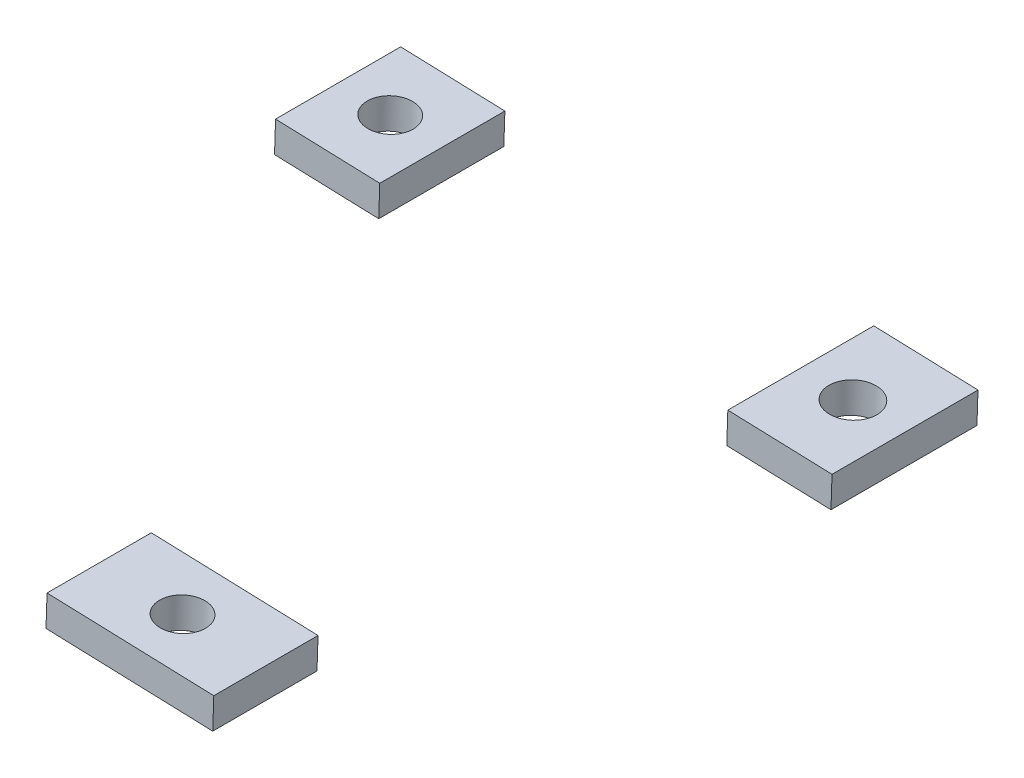
ISO-10303-21;
HEADER;
FILE_DESCRIPTION(('STEP AP214'),'2;1');
FILE_NAME('part.step','',(''),(''),'','','');
FILE_SCHEMA(('AUTOMOTIVE_DESIGN { 1 0 10303 214 1 1 1 1 }'));
ENDSEC;
DATA;
#1=APPLICATION_CONTEXT('core data for automotive mechanical design processes');
#2=APPLICATION_PROTOCOL_DEFINITION('international standard','automotive_design',2000,#1);
#3=PRODUCT_CONTEXT('',#1,'mechanical');
#4=PRODUCT('Part','Part','',(#3));
#5=PRODUCT_RELATED_PRODUCT_CATEGORY('part','',(#4));
#6=PRODUCT_DEFINITION_FORMATION('','',#4);
#7=PRODUCT_DEFINITION_CONTEXT('part definition',#1,'design');
#8=PRODUCT_DEFINITION('design','',#6,#7);
#9=PRODUCT_DEFINITION_SHAPE('','',#8);
#10=(LENGTH_UNIT() NAMED_UNIT(*) SI_UNIT(.MILLI.,.METRE.));
#11=(NAMED_UNIT(*) PLANE_ANGLE_UNIT() SI_UNIT($,.RADIAN.));
#12=(NAMED_UNIT(*) SI_UNIT($,.STERADIAN.) SOLID_ANGLE_UNIT());
#13=UNCERTAINTY_MEASURE_WITH_UNIT(LENGTH_MEASURE(1.E-05),#10,'distance_accuracy_value','');
#14=(GEOMETRIC_REPRESENTATION_CONTEXT(3) GLOBAL_UNCERTAINTY_ASSIGNED_CONTEXT((#13)) GLOBAL_UNIT_ASSIGNED_CONTEXT((#10,
#11,#12)) REPRESENTATION_CONTEXT('',''));
#15=CARTESIAN_POINT('',(0.,0.,0.));
#16=DIRECTION('',(0.,0.,1.));
#17=DIRECTION('',(1.,0.,0.));
#18=AXIS2_PLACEMENT_3D('',#15,#16,#17);
#19=CARTESIAN_POINT('',(0.212463980012952,6.35050439021801,0.));
#20=DIRECTION('',(0.0334375286000042,0.999440809493551,0.));
#21=DIRECTION('',(-0.999440809493551,0.0334375286000042,0.));
#22=AXIS2_PLACEMENT_3D('',#19,#20,#21);
#23=PLANE('',#22);
#24=DIRECTION('',(0.,0.,1.));
#25=VECTOR('',#24,1.);
#26=CARTESIAN_POINT('',(-129.601123923486,10.6935785542518,90.2089062050544));
#27=LINE('',#26,#25);
#28=CARTESIAN_POINT('',(-129.601123923486,10.6935785542518,90.2089062050544));
#29=VERTEX_POINT('',#28);
#30=CARTESIAN_POINT('',(-129.601123923486,10.6935785542518,96.2089063250876));
#31=VERTEX_POINT('',#30);
#32=EDGE_CURVE('E96',#29,#31,#27,.T.);
#33=ORIENTED_EDGE('',*,*,#32,.T.);
#34=DIRECTION('',(0.999440809493551,-0.0334375286000042,0.));
#35=VECTOR('',#34,1.);
#36=CARTESIAN_POINT('',(-129.601123923486,10.6935785542518,96.2089063250876));
#37=LINE('',#36,#35);
#38=CARTESIAN_POINT('',(-124.603919876019,10.5263909112517,96.2089063250876));
#39=VERTEX_POINT('',#38);
#40=EDGE_CURVE('E91',#31,#39,#37,.T.);
#41=ORIENTED_EDGE('',*,*,#40,.T.);
#42=DIRECTION('',(0.,0.,-1.));
#43=VECTOR('',#42,1.);
#44=CARTESIAN_POINT('',(-124.603919876019,10.5263909112517,90.2089062050544));
#45=LINE('',#44,#43);
#46=CARTESIAN_POINT('',(-124.603919876019,10.5263909112517,90.2089062050544));
#47=VERTEX_POINT('',#46);
#48=EDGE_CURVE('E94',#39,#47,#45,.T.);
#49=ORIENTED_EDGE('',*,*,#48,.T.);
#50=DIRECTION('',(-0.999440809493551,0.0334375286000041,0.));
#51=VECTOR('',#50,1.);
#52=CARTESIAN_POINT('',(-129.601123923486,10.6935785542518,90.2089062050544));
#53=LINE('',#52,#51);
#54=EDGE_CURVE('E61',#47,#29,#53,.T.);
#55=ORIENTED_EDGE('',*,*,#54,.T.);
#56=EDGE_LOOP('',(#33,#41,#49,#55));
#57=FACE_BOUND('',#56,.T.);
#58=CARTESIAN_POINT('',(-127.102521899752,10.6099847327518,93.2089064467498));
#59=DIRECTION('',(0.0334375286000042,0.999440809493551,0.));
#60=DIRECTION('',(-0.999440809493551,0.0334375286000042,0.));
#61=AXIS2_PLACEMENT_3D('',#58,#59,#60);
#62=CIRCLE('',#61,1.10000000000678);
#63=CARTESIAN_POINT('',(-128.201906790202,10.646766014212,93.2089064467498));
#64=VERTEX_POINT('',#63);
#65=EDGE_CURVE('E111',#64,#64,#62,.T.);
#66=ORIENTED_EDGE('',*,*,#65,.F.);
#67=EDGE_LOOP('',(#66));
#68=FACE_BOUND('',#67,.T.);
#69=ADVANCED_FACE('F44',(#57,#68),#23,.T.);
#70=CARTESIAN_POINT('',(0.162307687112946,4.85134317597768,0.));
#71=DIRECTION('',(0.0334375286000042,0.999440809493551,0.));
#72=DIRECTION('',(-0.999440809493551,0.0334375286000042,0.));
#73=AXIS2_PLACEMENT_3D('',#70,#71,#72);
#74=PLANE('',#73);
#75=DIRECTION('',(0.,0.,1.));
#76=VECTOR('',#75,1.);
#77=CARTESIAN_POINT('',(-129.651280216386,9.19441734001144,90.2089062050544));
#78=LINE('',#77,#76);
#79=CARTESIAN_POINT('',(-129.651280216386,9.19441734001144,90.2089062050544));
#80=VERTEX_POINT('',#79);
#81=CARTESIAN_POINT('',(-129.651280216386,9.19441734001144,96.2089063250876));
#82=VERTEX_POINT('',#81);
#83=EDGE_CURVE('E108',#80,#82,#78,.T.);
#84=ORIENTED_EDGE('',*,*,#83,.F.);
#85=DIRECTION('',(-0.999440809493551,0.0334375286000041,0.));
#86=VECTOR('',#85,1.);
#87=CARTESIAN_POINT('',(-129.651280216386,9.19441734001144,90.2089062050544));
#88=LINE('',#87,#86);
#89=CARTESIAN_POINT('',(-124.654076168919,9.02722969701142,90.2089062050544));
#90=VERTEX_POINT('',#89);
#91=EDGE_CURVE('E84',#90,#80,#88,.T.);
#92=ORIENTED_EDGE('',*,*,#91,.F.);
#93=DIRECTION('',(0.,0.,-1.));
#94=VECTOR('',#93,1.);
#95=CARTESIAN_POINT('',(-124.654076168919,9.02722969701142,90.2089062050544));
#96=LINE('',#95,#94);
#97=CARTESIAN_POINT('',(-124.654076168919,9.02722969701142,96.2089063250876));
#98=VERTEX_POINT('',#97);
#99=EDGE_CURVE('E78',#98,#90,#96,.T.);
#100=ORIENTED_EDGE('',*,*,#99,.F.);
#101=DIRECTION('',(0.999440809493551,-0.0334375286000042,0.));
#102=VECTOR('',#101,1.);
#103=CARTESIAN_POINT('',(-129.651280216386,9.19441734001144,96.2089063250876));
#104=LINE('',#103,#102);
#105=EDGE_CURVE('E100',#82,#98,#104,.T.);
#106=ORIENTED_EDGE('',*,*,#105,.F.);
#107=EDGE_LOOP('',(#84,#92,#100,#106));
#108=FACE_BOUND('',#107,.T.);
#109=CARTESIAN_POINT('',(-127.152678192652,9.11082351851143,93.2089064467498));
#110=DIRECTION('',(0.0334375286000042,0.999440809493551,0.));
#111=DIRECTION('',(-0.999440809493551,0.0334375286000042,0.));
#112=AXIS2_PLACEMENT_3D('',#109,#110,#111);
#113=CIRCLE('',#112,1.10000000000678);
#114=CARTESIAN_POINT('',(-128.252063083102,9.14760479997166,93.2089064467498));
#115=VERTEX_POINT('',#114);
#116=EDGE_CURVE('E123',#115,#115,#113,.T.);
#117=ORIENTED_EDGE('',*,*,#116,.T.);
#118=EDGE_LOOP('',(#117));
#119=FACE_BOUND('',#118,.T.);
#120=ADVANCED_FACE('F119',(#108,#119),#74,.F.);
#121=CARTESIAN_POINT('',(-129.601123923486,10.6935785542518,90.2089062050544));
#122=DIRECTION('',(0.999440809493551,-0.0334375286000042,0.));
#123=DIRECTION('',(0.0334375286000042,0.999440809493551,0.));
#124=AXIS2_PLACEMENT_3D('',#121,#122,#123);
#125=PLANE('',#124);
#126=ORIENTED_EDGE('',*,*,#83,.T.);
#127=DIRECTION('',(-0.0334375286000042,-0.999440809493551,0.));
#128=VECTOR('',#127,1.);
#129=CARTESIAN_POINT('',(-129.601123923486,10.6935785542518,96.2089063250876));
#130=LINE('',#129,#128);
#131=EDGE_CURVE('E12',#31,#82,#130,.T.);
#132=ORIENTED_EDGE('',*,*,#131,.F.);
#133=ORIENTED_EDGE('',*,*,#32,.F.);
#134=DIRECTION('',(-0.0334375286000042,-0.999440809493551,0.));
#135=VECTOR('',#134,1.);
#136=CARTESIAN_POINT('',(-129.601123923486,10.6935785542518,90.2089062050544));
#137=LINE('',#136,#135);
#138=EDGE_CURVE('E104',#29,#80,#137,.T.);
#139=ORIENTED_EDGE('',*,*,#138,.T.);
#140=EDGE_LOOP('',(#126,#132,#133,#139));
#141=FACE_BOUND('',#140,.T.);
#142=ADVANCED_FACE('F46',(#141),#125,.F.);
#143=CARTESIAN_POINT('',(-129.601123923486,10.6935785542518,96.2089063250876));
#144=DIRECTION('',(0.,0.,-1.));
#145=DIRECTION('',(-1.,0.,0.));
#146=AXIS2_PLACEMENT_3D('',#143,#144,#145);
#147=PLANE('',#146);
#148=ORIENTED_EDGE('',*,*,#105,.T.);
#149=DIRECTION('',(-0.0334375286000042,-0.999440809493551,0.));
#150=VECTOR('',#149,1.);
#151=CARTESIAN_POINT('',(-124.603919876019,10.5263909112517,96.2089063250876));
#152=LINE('',#151,#150);
#153=EDGE_CURVE('E53',#39,#98,#152,.T.);
#154=ORIENTED_EDGE('',*,*,#153,.F.);
#155=ORIENTED_EDGE('',*,*,#40,.F.);
#156=ORIENTED_EDGE('',*,*,#131,.T.);
#157=EDGE_LOOP('',(#148,#154,#155,#156));
#158=FACE_BOUND('',#157,.T.);
#159=ADVANCED_FACE('F99',(#158),#147,.F.);
#160=CARTESIAN_POINT('',(-124.603919876019,10.5263909112517,90.2089062050544));
#161=DIRECTION('',(-0.999440809493551,0.0334375286000042,0.));
#162=DIRECTION('',(-0.0334375286000042,-0.999440809493551,0.));
#163=AXIS2_PLACEMENT_3D('',#160,#161,#162);
#164=PLANE('',#163);
#165=ORIENTED_EDGE('',*,*,#99,.T.);
#166=DIRECTION('',(-0.0334375286000042,-0.999440809493551,0.));
#167=VECTOR('',#166,1.);
#168=CARTESIAN_POINT('',(-124.603919876019,10.5263909112517,90.2089062050544));
#169=LINE('',#168,#167);
#170=EDGE_CURVE('E101',#47,#90,#169,.T.);
#171=ORIENTED_EDGE('',*,*,#170,.F.);
#172=ORIENTED_EDGE('',*,*,#48,.F.);
#173=ORIENTED_EDGE('',*,*,#153,.T.);
#174=EDGE_LOOP('',(#165,#171,#172,#173));
#175=FACE_BOUND('',#174,.T.);
#176=ADVANCED_FACE('F102',(#175),#164,.F.);
#177=CARTESIAN_POINT('',(-129.601123923486,10.6935785542518,90.2089062050544));
#178=DIRECTION('',(0.,0.,1.));
#179=DIRECTION('',(1.,0.,0.));
#180=AXIS2_PLACEMENT_3D('',#177,#178,#179);
#181=PLANE('',#180);
#182=ORIENTED_EDGE('',*,*,#91,.T.);
#183=ORIENTED_EDGE('',*,*,#138,.F.);
#184=ORIENTED_EDGE('',*,*,#54,.F.);
#185=ORIENTED_EDGE('',*,*,#170,.T.);
#186=EDGE_LOOP('',(#182,#183,#184,#185));
#187=FACE_BOUND('',#186,.T.);
#188=ADVANCED_FACE('F116',(#187),#181,.F.);
#189=CARTESIAN_POINT('',(-127.102521899752,10.6099847327518,93.2089064467498));
#190=DIRECTION('',(-0.0334375286000042,-0.999440809493551,0.));
#191=DIRECTION('',(0.999440809493551,-0.0334375286000042,0.));
#192=AXIS2_PLACEMENT_3D('',#189,#190,#191);
#193=CYLINDRICAL_SURFACE('',#192,1.10000000000678);
#194=ORIENTED_EDGE('',*,*,#65,.T.);
#195=EDGE_LOOP('',(#194));
#196=FACE_BOUND('',#195,.T.);
#197=ORIENTED_EDGE('',*,*,#116,.F.);
#198=EDGE_LOOP('',(#197));
#199=FACE_BOUND('',#198,.T.);
#200=ADVANCED_FACE('F129',(#196,#199),#193,.F.);
#201=CLOSED_SHELL('',(#69,#120,#142,#159,#176,#188,#200));
#202=MANIFOLD_SOLID_BREP('B2',#201);
#203=CARTESIAN_POINT('',(0.212463980012953,6.35050439021802,0.));
#204=DIRECTION('',(-0.0334375286000043,-0.999440809493551,0.));
#205=DIRECTION('',(0.999440809493551,-0.0334375286000043,0.));
#206=AXIS2_PLACEMENT_3D('',#203,#204,#205);
#207=PLANE('',#206);
#208=DIRECTION('',(0.,0.,1.));
#209=VECTOR('',#208,1.);
#210=CARTESIAN_POINT('',(-107.41353795273,9.95126541933168,96.7089074171427));
#211=LINE('',#210,#209);
#212=CARTESIAN_POINT('',(-107.41353795273,9.95126541933168,89.7089074171427));
#213=VERTEX_POINT('',#212);
#214=CARTESIAN_POINT('',(-107.41353795273,9.95126541933168,96.7089074171427));
#215=VERTEX_POINT('',#214);
#216=EDGE_CURVE('E250',#213,#215,#211,.T.);
#217=ORIENTED_EDGE('',*,*,#216,.T.);
#218=DIRECTION('',(0.999440809493551,-0.033437528600004,0.));
#219=VECTOR('',#218,1.);
#220=CARTESIAN_POINT('',(-107.41353795273,9.95126541933168,96.7089074171427));
#221=LINE('',#220,#219);
#222=CARTESIAN_POINT('',(-102.416333905262,9.78407777633165,96.7089074171426));
#223=VERTEX_POINT('',#222);
#224=EDGE_CURVE('E245',#215,#223,#221,.T.);
#225=ORIENTED_EDGE('',*,*,#224,.T.);
#226=DIRECTION('',(0.,0.,-1.));
#227=VECTOR('',#226,1.);
#228=CARTESIAN_POINT('',(-102.416333905262,9.78407777633165,96.7089074171426));
#229=LINE('',#228,#227);
#230=CARTESIAN_POINT('',(-102.416333905262,9.78407777633165,89.7089074171426));
#231=VERTEX_POINT('',#230);
#232=EDGE_CURVE('E248',#223,#231,#229,.T.);
#233=ORIENTED_EDGE('',*,*,#232,.T.);
#234=DIRECTION('',(-0.999440809493551,0.0334375286000043,0.));
#235=VECTOR('',#234,1.);
#236=CARTESIAN_POINT('',(-107.41353795273,9.95126541933168,89.7089074171427));
#237=LINE('',#236,#235);
#238=EDGE_CURVE('E215',#231,#213,#237,.T.);
#239=ORIENTED_EDGE('',*,*,#238,.T.);
#240=EDGE_LOOP('',(#217,#225,#233,#239));
#241=FACE_BOUND('',#240,.T.);
#242=CARTESIAN_POINT('',(-104.914935928996,9.86767159783167,93.2089074171426));
#243=DIRECTION('',(0.0334375286000042,0.999440809493551,0.));
#244=DIRECTION('',(-0.999440809493551,0.0334375286000042,0.));
#245=AXIS2_PLACEMENT_3D('',#242,#243,#244);
#246=CIRCLE('',#245,1.15000000000682);
#247=CARTESIAN_POINT('',(-106.06429285992,9.9061247557219,93.2089074171426));
#248=VERTEX_POINT('',#247);
#249=EDGE_CURVE('E265',#248,#248,#246,.T.);
#250=ORIENTED_EDGE('',*,*,#249,.F.);
#251=EDGE_LOOP('',(#250));
#252=FACE_BOUND('',#251,.T.);
#253=ADVANCED_FACE('F198',(#241,#252),#207,.F.);
#254=CARTESIAN_POINT('',(0.162307687112947,4.85134317597769,0.));
#255=DIRECTION('',(-0.0334375286000043,-0.999440809493551,0.));
#256=DIRECTION('',(0.999440809493551,-0.0334375286000043,0.));
#257=AXIS2_PLACEMENT_3D('',#254,#255,#256);
#258=PLANE('',#257);
#259=DIRECTION('',(0.,0.,1.));
#260=VECTOR('',#259,1.);
#261=CARTESIAN_POINT('',(-107.46369424563,8.45210420509135,96.7089074171427));
#262=LINE('',#261,#260);
#263=CARTESIAN_POINT('',(-107.46369424563,8.45210420509135,89.7089074171427));
#264=VERTEX_POINT('',#263);
#265=CARTESIAN_POINT('',(-107.46369424563,8.45210420509135,96.7089074171427));
#266=VERTEX_POINT('',#265);
#267=EDGE_CURVE('E262',#264,#266,#262,.T.);
#268=ORIENTED_EDGE('',*,*,#267,.F.);
#269=DIRECTION('',(-0.999440809493551,0.0334375286000043,0.));
#270=VECTOR('',#269,1.);
#271=CARTESIAN_POINT('',(-107.46369424563,8.45210420509135,89.7089074171427));
#272=LINE('',#271,#270);
#273=CARTESIAN_POINT('',(-102.466490198162,8.28491656209133,89.7089074171426));
#274=VERTEX_POINT('',#273);
#275=EDGE_CURVE('E238',#274,#264,#272,.T.);
#276=ORIENTED_EDGE('',*,*,#275,.F.);
#277=DIRECTION('',(0.,0.,-1.));
#278=VECTOR('',#277,1.);
#279=CARTESIAN_POINT('',(-102.466490198162,8.28491656209133,96.7089074171426));
#280=LINE('',#279,#278);
#281=CARTESIAN_POINT('',(-102.466490198162,8.28491656209133,96.7089074171426));
#282=VERTEX_POINT('',#281);
#283=EDGE_CURVE('E232',#282,#274,#280,.T.);
#284=ORIENTED_EDGE('',*,*,#283,.F.);
#285=DIRECTION('',(0.999440809493551,-0.033437528600004,0.));
#286=VECTOR('',#285,1.);
#287=CARTESIAN_POINT('',(-107.46369424563,8.45210420509135,96.7089074171427));
#288=LINE('',#287,#286);
#289=EDGE_CURVE('E254',#266,#282,#288,.T.);
#290=ORIENTED_EDGE('',*,*,#289,.F.);
#291=EDGE_LOOP('',(#268,#276,#284,#290));
#292=FACE_BOUND('',#291,.T.);
#293=CARTESIAN_POINT('',(-104.965092221896,8.36851038359134,93.2089074171426));
#294=DIRECTION('',(0.0334375286000042,0.999440809493551,0.));
#295=DIRECTION('',(-0.999440809493551,0.0334375286000042,0.));
#296=AXIS2_PLACEMENT_3D('',#293,#294,#295);
#297=CIRCLE('',#296,1.15000000000682);
#298=CARTESIAN_POINT('',(-106.11444915282,8.40696354148157,93.2089074171426));
#299=VERTEX_POINT('',#298);
#300=EDGE_CURVE('E277',#299,#299,#297,.T.);
#301=ORIENTED_EDGE('',*,*,#300,.T.);
#302=EDGE_LOOP('',(#301));
#303=FACE_BOUND('',#302,.T.);
#304=ADVANCED_FACE('F273',(#292,#303),#258,.T.);
#305=CARTESIAN_POINT('',(-107.41353795273,9.95126541933168,96.7089074171427));
#306=DIRECTION('',(0.999440809493551,-0.0334375286000042,0.));
#307=DIRECTION('',(0.0334375286000042,0.999440809493551,0.));
#308=AXIS2_PLACEMENT_3D('',#305,#306,#307);
#309=PLANE('',#308);
#310=ORIENTED_EDGE('',*,*,#267,.T.);
#311=DIRECTION('',(-0.0334375286000042,-0.999440809493551,0.));
#312=VECTOR('',#311,1.);
#313=CARTESIAN_POINT('',(-107.41353795273,9.95126541933168,96.7089074171427));
#314=LINE('',#313,#312);
#315=EDGE_CURVE('E42',#215,#266,#314,.T.);
#316=ORIENTED_EDGE('',*,*,#315,.F.);
#317=ORIENTED_EDGE('',*,*,#216,.F.);
#318=DIRECTION('',(-0.0334375286000042,-0.999440809493551,0.));
#319=VECTOR('',#318,1.);
#320=CARTESIAN_POINT('',(-107.41353795273,9.95126541933168,89.7089074171427));
#321=LINE('',#320,#319);
#322=EDGE_CURVE('E258',#213,#264,#321,.T.);
#323=ORIENTED_EDGE('',*,*,#322,.T.);
#324=EDGE_LOOP('',(#310,#316,#317,#323));
#325=FACE_BOUND('',#324,.T.);
#326=ADVANCED_FACE('F200',(#325),#309,.F.);
#327=CARTESIAN_POINT('',(-107.41353795273,9.95126541933168,96.7089074171427));
#328=DIRECTION('',(0.,0.,-1.));
#329=DIRECTION('',(-1.,0.,0.));
#330=AXIS2_PLACEMENT_3D('',#327,#328,#329);
#331=PLANE('',#330);
#332=ORIENTED_EDGE('',*,*,#289,.T.);
#333=DIRECTION('',(-0.0334375286000042,-0.999440809493551,0.));
#334=VECTOR('',#333,1.);
#335=CARTESIAN_POINT('',(-102.416333905262,9.78407777633165,96.7089074171426));
#336=LINE('',#335,#334);
#337=EDGE_CURVE('E207',#223,#282,#336,.T.);
#338=ORIENTED_EDGE('',*,*,#337,.F.);
#339=ORIENTED_EDGE('',*,*,#224,.F.);
#340=ORIENTED_EDGE('',*,*,#315,.T.);
#341=EDGE_LOOP('',(#332,#338,#339,#340));
#342=FACE_BOUND('',#341,.T.);
#343=ADVANCED_FACE('F253',(#342),#331,.F.);
#344=CARTESIAN_POINT('',(-102.416333905262,9.78407777633165,96.7089074171426));
#345=DIRECTION('',(-0.999440809493551,0.0334375286000042,0.));
#346=DIRECTION('',(-0.0334375286000042,-0.999440809493551,0.));
#347=AXIS2_PLACEMENT_3D('',#344,#345,#346);
#348=PLANE('',#347);
#349=ORIENTED_EDGE('',*,*,#283,.T.);
#350=DIRECTION('',(-0.0334375286000042,-0.999440809493551,0.));
#351=VECTOR('',#350,1.);
#352=CARTESIAN_POINT('',(-102.416333905262,9.78407777633165,89.7089074171426));
#353=LINE('',#352,#351);
#354=EDGE_CURVE('E255',#231,#274,#353,.T.);
#355=ORIENTED_EDGE('',*,*,#354,.F.);
#356=ORIENTED_EDGE('',*,*,#232,.F.);
#357=ORIENTED_EDGE('',*,*,#337,.T.);
#358=EDGE_LOOP('',(#349,#355,#356,#357));
#359=FACE_BOUND('',#358,.T.);
#360=ADVANCED_FACE('F256',(#359),#348,.F.);
#361=CARTESIAN_POINT('',(-107.41353795273,9.95126541933168,89.7089074171427));
#362=DIRECTION('',(0.,0.,1.));
#363=DIRECTION('',(1.,0.,0.));
#364=AXIS2_PLACEMENT_3D('',#361,#362,#363);
#365=PLANE('',#364);
#366=ORIENTED_EDGE('',*,*,#275,.T.);
#367=ORIENTED_EDGE('',*,*,#322,.F.);
#368=ORIENTED_EDGE('',*,*,#238,.F.);
#369=ORIENTED_EDGE('',*,*,#354,.T.);
#370=EDGE_LOOP('',(#366,#367,#368,#369));
#371=FACE_BOUND('',#370,.T.);
#372=ADVANCED_FACE('F270',(#371),#365,.F.);
#373=CARTESIAN_POINT('',(-104.914935928996,9.86767159783167,93.2089074171426));
#374=DIRECTION('',(-0.0334375286000042,-0.999440809493551,0.));
#375=DIRECTION('',(0.999440809493551,-0.0334375286000042,0.));
#376=AXIS2_PLACEMENT_3D('',#373,#374,#375);
#377=CYLINDRICAL_SURFACE('',#376,1.15000000000682);
#378=ORIENTED_EDGE('',*,*,#249,.T.);
#379=EDGE_LOOP('',(#378));
#380=FACE_BOUND('',#379,.T.);
#381=ORIENTED_EDGE('',*,*,#300,.F.);
#382=EDGE_LOOP('',(#381));
#383=FACE_BOUND('',#382,.T.);
#384=ADVANCED_FACE('F283',(#380,#383),#377,.F.);
#385=CLOSED_SHELL('',(#253,#304,#326,#343,#360,#372,#384));
#386=MANIFOLD_SOLID_BREP('B6',#385);
#387=CARTESIAN_POINT('',(0.212463980012952,6.35050439021799,0.));
#388=DIRECTION('',(0.0334375286000043,0.999440809493551,0.));
#389=DIRECTION('',(-0.999440809493551,0.0334375286000043,0.));
#390=AXIS2_PLACEMENT_3D('',#387,#388,#389);
#391=PLANE('',#390);
#392=DIRECTION('',(0.,0.,1.));
#393=VECTOR('',#392,1.);
#394=CARTESIAN_POINT('',(-115.858813893861,10.2338125728341,115.908907113349));
#395=LINE('',#394,#393);
#396=CARTESIAN_POINT('',(-115.858813893861,10.2338125728341,115.908907113349));
#397=VERTEX_POINT('',#396);
#398=CARTESIAN_POINT('',(-115.858813893861,10.2338125728341,120.908907113349));
#399=VERTEX_POINT('',#398);
#400=EDGE_CURVE('E395',#397,#399,#395,.T.);
#401=ORIENTED_EDGE('',*,*,#400,.T.);
#402=DIRECTION('',(0.999440809493551,-0.0334375286000043,0.));
#403=VECTOR('',#402,1.);
#404=CARTESIAN_POINT('',(-115.858813893861,10.2338125728341,120.908907113349));
#405=LINE('',#404,#403);
#406=CARTESIAN_POINT('',(-107.863287417913,9.96631234403402,120.908907113348));
#407=VERTEX_POINT('',#406);
#408=EDGE_CURVE('E390',#399,#407,#405,.T.);
#409=ORIENTED_EDGE('',*,*,#408,.T.);
#410=DIRECTION('',(0.,0.,-1.));
#411=VECTOR('',#410,1.);
#412=CARTESIAN_POINT('',(-107.863287417913,9.96631234403402,115.908907113348));
#413=LINE('',#412,#411);
#414=CARTESIAN_POINT('',(-107.863287417913,9.96631234403402,115.908907113348));
#415=VERTEX_POINT('',#414);
#416=EDGE_CURVE('E393',#407,#415,#413,.T.);
#417=ORIENTED_EDGE('',*,*,#416,.T.);
#418=DIRECTION('',(-0.999440809493551,0.0334375286000041,0.));
#419=VECTOR('',#418,1.);
#420=CARTESIAN_POINT('',(-115.858813893861,10.2338125728341,115.908907113349));
#421=LINE('',#420,#419);
#422=EDGE_CURVE('E360',#415,#397,#421,.T.);
#423=ORIENTED_EDGE('',*,*,#422,.T.);
#424=EDGE_LOOP('',(#401,#409,#417,#423));
#425=FACE_BOUND('',#424,.T.);
#426=CARTESIAN_POINT('',(-111.861050655887,10.100062458434,118.408907113348));
#427=DIRECTION('',(0.0334375286000042,0.999440809493551,0.));
#428=DIRECTION('',(-0.999440809493551,0.0334375286000042,0.));
#429=AXIS2_PLACEMENT_3D('',#426,#427,#428);
#430=CIRCLE('',#429,1.1000000000068);
#431=CARTESIAN_POINT('',(-112.960435546337,10.1368437398943,118.408907113348));
#432=VERTEX_POINT('',#431);
#433=EDGE_CURVE('E410',#432,#432,#430,.T.);
#434=ORIENTED_EDGE('',*,*,#433,.F.);
#435=EDGE_LOOP('',(#434));
#436=FACE_BOUND('',#435,.T.);
#437=ADVANCED_FACE('F343',(#425,#436),#391,.T.);
#438=CARTESIAN_POINT('',(0.162307687112946,4.85134317597767,0.));
#439=DIRECTION('',(0.0334375286000043,0.999440809493551,0.));
#440=DIRECTION('',(-0.999440809493551,0.0334375286000043,0.));
#441=AXIS2_PLACEMENT_3D('',#438,#439,#440);
#442=PLANE('',#441);
#443=DIRECTION('',(0.,0.,1.));
#444=VECTOR('',#443,1.);
#445=CARTESIAN_POINT('',(-115.908970186761,8.73465135859373,115.908907113349));
#446=LINE('',#445,#444);
#447=CARTESIAN_POINT('',(-115.908970186761,8.73465135859373,115.908907113349));
#448=VERTEX_POINT('',#447);
#449=CARTESIAN_POINT('',(-115.908970186761,8.73465135859373,120.908907113349));
#450=VERTEX_POINT('',#449);
#451=EDGE_CURVE('E407',#448,#450,#446,.T.);
#452=ORIENTED_EDGE('',*,*,#451,.F.);
#453=DIRECTION('',(-0.999440809493551,0.0334375286000041,0.));
#454=VECTOR('',#453,1.);
#455=CARTESIAN_POINT('',(-115.908970186761,8.73465135859373,115.908907113349));
#456=LINE('',#455,#454);
#457=CARTESIAN_POINT('',(-107.913443710813,8.46715112979369,115.908907113348));
#458=VERTEX_POINT('',#457);
#459=EDGE_CURVE('E383',#458,#448,#456,.T.);
#460=ORIENTED_EDGE('',*,*,#459,.F.);
#461=DIRECTION('',(0.,0.,-1.));
#462=VECTOR('',#461,1.);
#463=CARTESIAN_POINT('',(-107.913443710813,8.46715112979369,115.908907113348));
#464=LINE('',#463,#462);
#465=CARTESIAN_POINT('',(-107.913443710813,8.46715112979369,120.908907113348));
#466=VERTEX_POINT('',#465);
#467=EDGE_CURVE('E377',#466,#458,#464,.T.);
#468=ORIENTED_EDGE('',*,*,#467,.F.);
#469=DIRECTION('',(0.999440809493551,-0.0334375286000043,0.));
#470=VECTOR('',#469,1.);
#471=CARTESIAN_POINT('',(-115.908970186761,8.73465135859373,120.908907113349));
#472=LINE('',#471,#470);
#473=EDGE_CURVE('E399',#450,#466,#472,.T.);
#474=ORIENTED_EDGE('',*,*,#473,.F.);
#475=EDGE_LOOP('',(#452,#460,#468,#474));
#476=FACE_BOUND('',#475,.T.);
#477=CARTESIAN_POINT('',(-111.911206948787,8.60090124419371,118.408907113348));
#478=DIRECTION('',(0.0334375286000042,0.999440809493551,0.));
#479=DIRECTION('',(-0.999440809493551,0.0334375286000042,0.));
#480=AXIS2_PLACEMENT_3D('',#477,#478,#479);
#481=CIRCLE('',#480,1.1000000000068);
#482=CARTESIAN_POINT('',(-113.010591839237,8.63768252565394,118.408907113348));
#483=VERTEX_POINT('',#482);
#484=EDGE_CURVE('E422',#483,#483,#481,.T.);
#485=ORIENTED_EDGE('',*,*,#484,.T.);
#486=EDGE_LOOP('',(#485));
#487=FACE_BOUND('',#486,.T.);
#488=ADVANCED_FACE('F418',(#476,#487),#442,.F.);
#489=CARTESIAN_POINT('',(-115.858813893861,10.2338125728341,115.908907113349));
#490=DIRECTION('',(0.999440809493551,-0.0334375286000042,0.));
#491=DIRECTION('',(0.0334375286000042,0.999440809493551,0.));
#492=AXIS2_PLACEMENT_3D('',#489,#490,#491);
#493=PLANE('',#492);
#494=ORIENTED_EDGE('',*,*,#451,.T.);
#495=DIRECTION('',(-0.0334375286000042,-0.999440809493551,0.));
#496=VECTOR('',#495,1.);
#497=CARTESIAN_POINT('',(-115.858813893861,10.2338125728341,120.908907113349));
#498=LINE('',#497,#496);
#499=EDGE_CURVE('E196',#399,#450,#498,.T.);
#500=ORIENTED_EDGE('',*,*,#499,.F.);
#501=ORIENTED_EDGE('',*,*,#400,.F.);
#502=DIRECTION('',(-0.0334375286000042,-0.999440809493551,0.));
#503=VECTOR('',#502,1.);
#504=CARTESIAN_POINT('',(-115.858813893861,10.2338125728341,115.908907113349));
#505=LINE('',#504,#503);
#506=EDGE_CURVE('E403',#397,#448,#505,.T.);
#507=ORIENTED_EDGE('',*,*,#506,.T.);
#508=EDGE_LOOP('',(#494,#500,#501,#507));
#509=FACE_BOUND('',#508,.T.);
#510=ADVANCED_FACE('F345',(#509),#493,.F.);
#511=CARTESIAN_POINT('',(-115.858813893861,10.2338125728341,120.908907113349));
#512=DIRECTION('',(0.,0.,-1.));
#513=DIRECTION('',(-1.,0.,0.));
#514=AXIS2_PLACEMENT_3D('',#511,#512,#513);
#515=PLANE('',#514);
#516=ORIENTED_EDGE('',*,*,#473,.T.);
#517=DIRECTION('',(-0.0334375286000042,-0.999440809493551,0.));
#518=VECTOR('',#517,1.);
#519=CARTESIAN_POINT('',(-107.863287417913,9.96631234403402,120.908907113348));
#520=LINE('',#519,#518);
#521=EDGE_CURVE('E352',#407,#466,#520,.T.);
#522=ORIENTED_EDGE('',*,*,#521,.F.);
#523=ORIENTED_EDGE('',*,*,#408,.F.);
#524=ORIENTED_EDGE('',*,*,#499,.T.);
#525=EDGE_LOOP('',(#516,#522,#523,#524));
#526=FACE_BOUND('',#525,.T.);
#527=ADVANCED_FACE('F398',(#526),#515,.F.);
#528=CARTESIAN_POINT('',(-107.863287417913,9.96631234403402,115.908907113348));
#529=DIRECTION('',(-0.999440809493551,0.0334375286000042,0.));
#530=DIRECTION('',(-0.0334375286000042,-0.999440809493551,0.));
#531=AXIS2_PLACEMENT_3D('',#528,#529,#530);
#532=PLANE('',#531);
#533=ORIENTED_EDGE('',*,*,#467,.T.);
#534=DIRECTION('',(-0.0334375286000042,-0.999440809493551,0.));
#535=VECTOR('',#534,1.);
#536=CARTESIAN_POINT('',(-107.863287417913,9.96631234403402,115.908907113348));
#537=LINE('',#536,#535);
#538=EDGE_CURVE('E400',#415,#458,#537,.T.);
#539=ORIENTED_EDGE('',*,*,#538,.F.);
#540=ORIENTED_EDGE('',*,*,#416,.F.);
#541=ORIENTED_EDGE('',*,*,#521,.T.);
#542=EDGE_LOOP('',(#533,#539,#540,#541));
#543=FACE_BOUND('',#542,.T.);
#544=ADVANCED_FACE('F401',(#543),#532,.F.);
#545=CARTESIAN_POINT('',(-115.858813893861,10.2338125728341,115.908907113349));
#546=DIRECTION('',(0.,0.,1.));
#547=DIRECTION('',(1.,0.,0.));
#548=AXIS2_PLACEMENT_3D('',#545,#546,#547);
#549=PLANE('',#548);
#550=ORIENTED_EDGE('',*,*,#459,.T.);
#551=ORIENTED_EDGE('',*,*,#506,.F.);
#552=ORIENTED_EDGE('',*,*,#422,.F.);
#553=ORIENTED_EDGE('',*,*,#538,.T.);
#554=EDGE_LOOP('',(#550,#551,#552,#553));
#555=FACE_BOUND('',#554,.T.);
#556=ADVANCED_FACE('F415',(#555),#549,.F.);
#557=CARTESIAN_POINT('',(-111.861050655887,10.100062458434,118.408907113348));
#558=DIRECTION('',(-0.0334375286000042,-0.999440809493551,0.));
#559=DIRECTION('',(0.999440809493551,-0.0334375286000042,0.));
#560=AXIS2_PLACEMENT_3D('',#557,#558,#559);
#561=CYLINDRICAL_SURFACE('',#560,1.1000000000068);
#562=ORIENTED_EDGE('',*,*,#433,.T.);
#563=EDGE_LOOP('',(#562));
#564=FACE_BOUND('',#563,.T.);
#565=ORIENTED_EDGE('',*,*,#484,.F.);
#566=EDGE_LOOP('',(#565));
#567=FACE_BOUND('',#566,.T.);
#568=ADVANCED_FACE('F428',(#564,#567),#561,.F.);
#569=CLOSED_SHELL('',(#437,#488,#510,#527,#544,#556,#568));
#570=MANIFOLD_SOLID_BREP('B36',#569);
#571=ADVANCED_BREP_SHAPE_REPRESENTATION('',(#18,#202,#386,#570),#14);
#572=SHAPE_DEFINITION_REPRESENTATION(#9,#571);
ENDSEC;
END-ISO-10303-21;
